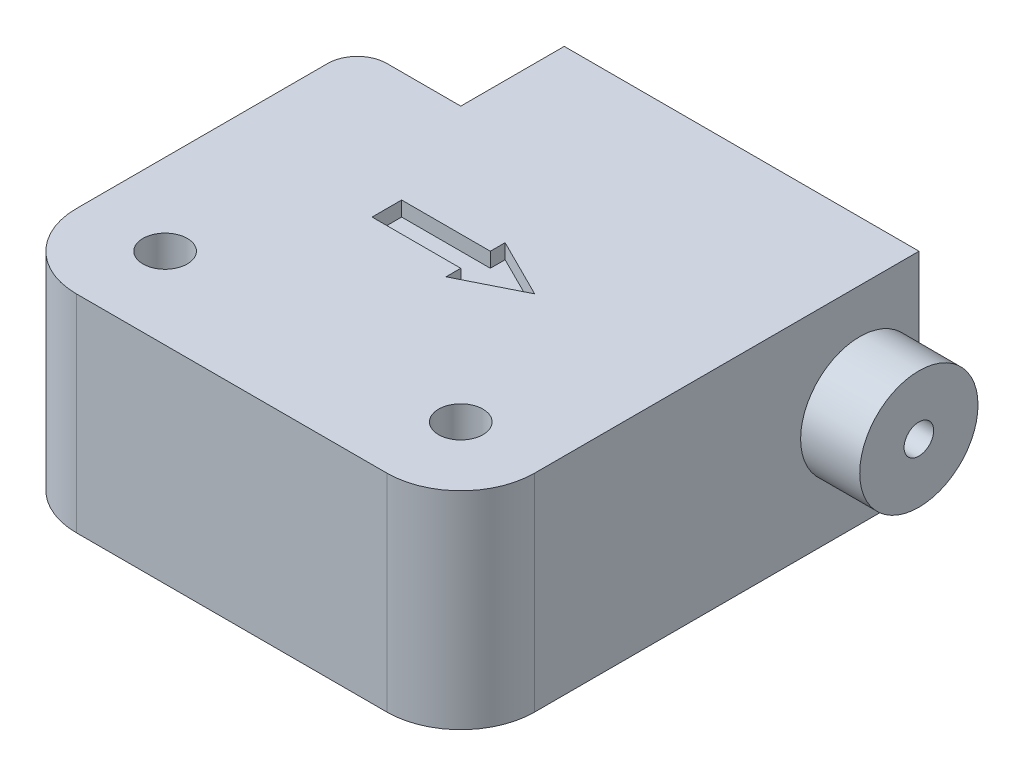
ISO-10303-21;
HEADER;
FILE_DESCRIPTION(('STEP AP214'),'2;1');
FILE_NAME('part.step','',(''),(''),'','','');
FILE_SCHEMA(('AUTOMOTIVE_DESIGN { 1 0 10303 214 1 1 1 1 }'));
ENDSEC;
DATA;
#1=APPLICATION_CONTEXT('core data for automotive mechanical design processes');
#2=APPLICATION_PROTOCOL_DEFINITION('international standard','automotive_design',2000,#1);
#3=PRODUCT_CONTEXT('',#1,'mechanical');
#4=PRODUCT('Part','Part','',(#3));
#5=PRODUCT_RELATED_PRODUCT_CATEGORY('part','',(#4));
#6=PRODUCT_DEFINITION_FORMATION('','',#4);
#7=PRODUCT_DEFINITION_CONTEXT('part definition',#1,'design');
#8=PRODUCT_DEFINITION('design','',#6,#7);
#9=PRODUCT_DEFINITION_SHAPE('','',#8);
#10=(LENGTH_UNIT() NAMED_UNIT(*) SI_UNIT(.MILLI.,.METRE.));
#11=(NAMED_UNIT(*) PLANE_ANGLE_UNIT() SI_UNIT($,.RADIAN.));
#12=(NAMED_UNIT(*) SI_UNIT($,.STERADIAN.) SOLID_ANGLE_UNIT());
#13=UNCERTAINTY_MEASURE_WITH_UNIT(LENGTH_MEASURE(1.E-05),#10,'distance_accuracy_value','');
#14=(GEOMETRIC_REPRESENTATION_CONTEXT(3) GLOBAL_UNCERTAINTY_ASSIGNED_CONTEXT((#13)) GLOBAL_UNIT_ASSIGNED_CONTEXT((#10,
#11,#12)) REPRESENTATION_CONTEXT('',''));
#15=CARTESIAN_POINT('',(0.,0.,0.));
#16=DIRECTION('',(0.,0.,1.));
#17=DIRECTION('',(1.,0.,0.));
#18=AXIS2_PLACEMENT_3D('',#15,#16,#17);
#19=CARTESIAN_POINT('',(-8.5,14.,0.));
#20=DIRECTION('',(1.,0.,0.));
#21=DIRECTION('',(0.,0.,-1.));
#22=AXIS2_PLACEMENT_3D('',#19,#20,#21);
#23=PLANE('',#22);
#24=CARTESIAN_POINT('',(-8.5,7.,-11.49));
#25=DIRECTION('',(1.,0.,0.));
#26=DIRECTION('',(0.,0.,-1.));
#27=AXIS2_PLACEMENT_3D('',#24,#25,#26);
#28=CIRCLE('',#27,1.);
#29=CARTESIAN_POINT('',(-8.5,7.,-12.49));
#30=VERTEX_POINT('',#29);
#31=EDGE_CURVE('E359',#30,#30,#28,.T.);
#32=ORIENTED_EDGE('',*,*,#31,.T.);
#33=EDGE_LOOP('',(#32));
#34=FACE_BOUND('',#33,.T.);
#35=DIRECTION('',(0.,0.,1.));
#36=VECTOR('',#35,1.);
#37=CARTESIAN_POINT('',(-8.5,0.,0.));
#38=LINE('',#37,#36);
#39=CARTESIAN_POINT('',(-8.5,0.,-15.5));
#40=VERTEX_POINT('',#39);
#41=CARTESIAN_POINT('',(-8.5,0.,-8.5));
#42=VERTEX_POINT('',#41);
#43=EDGE_CURVE('E407',#40,#42,#38,.T.);
#44=ORIENTED_EDGE('',*,*,#43,.T.);
#45=DIRECTION('',(0.,-1.,0.));
#46=VECTOR('',#45,1.);
#47=CARTESIAN_POINT('',(-8.5,14.,-8.5));
#48=LINE('',#47,#46);
#49=CARTESIAN_POINT('',(-8.5,14.,-8.5));
#50=VERTEX_POINT('',#49);
#51=EDGE_CURVE('E434',#50,#42,#48,.T.);
#52=ORIENTED_EDGE('',*,*,#51,.F.);
#53=DIRECTION('',(0.,0.,1.));
#54=VECTOR('',#53,1.);
#55=CARTESIAN_POINT('',(-8.5,14.,0.));
#56=LINE('',#55,#54);
#57=CARTESIAN_POINT('',(-8.5,14.,-15.5));
#58=VERTEX_POINT('',#57);
#59=EDGE_CURVE('E377',#58,#50,#56,.T.);
#60=ORIENTED_EDGE('',*,*,#59,.F.);
#61=DIRECTION('',(0.,-1.,0.));
#62=VECTOR('',#61,1.);
#63=CARTESIAN_POINT('',(-8.5,14.,-15.5));
#64=LINE('',#63,#62);
#65=EDGE_CURVE('E399',#58,#40,#64,.T.);
#66=ORIENTED_EDGE('',*,*,#65,.T.);
#67=EDGE_LOOP('',(#44,#52,#60,#66));
#68=FACE_BOUND('',#67,.T.);
#69=ADVANCED_FACE('F41',(#34,#68),#23,.F.);
#70=CARTESIAN_POINT('',(0.,14.,-8.5));
#71=DIRECTION('',(0.,0.,1.));
#72=DIRECTION('',(1.,0.,0.));
#73=AXIS2_PLACEMENT_3D('',#70,#71,#72);
#74=PLANE('',#73);
#75=DIRECTION('',(-1.,0.,0.));
#76=VECTOR('',#75,1.);
#77=CARTESIAN_POINT('',(0.,0.,-8.5));
#78=LINE('',#77,#76);
#79=CARTESIAN_POINT('',(-13.5,0.,-8.5));
#80=VERTEX_POINT('',#79);
#81=EDGE_CURVE('E411',#42,#80,#78,.T.);
#82=ORIENTED_EDGE('',*,*,#81,.T.);
#83=DIRECTION('',(0.,-1.,0.));
#84=VECTOR('',#83,1.);
#85=CARTESIAN_POINT('',(-13.5,14.,-8.5));
#86=LINE('',#85,#84);
#87=CARTESIAN_POINT('',(-13.5,14.,-8.5));
#88=VERTEX_POINT('',#87);
#89=EDGE_CURVE('E473',#80,#88,#86,.F.);
#90=ORIENTED_EDGE('',*,*,#89,.T.);
#91=DIRECTION('',(-1.,0.,0.));
#92=VECTOR('',#91,1.);
#93=CARTESIAN_POINT('',(0.,14.,-8.5));
#94=LINE('',#93,#92);
#95=EDGE_CURVE('E381',#50,#88,#94,.T.);
#96=ORIENTED_EDGE('',*,*,#95,.F.);
#97=ORIENTED_EDGE('',*,*,#51,.T.);
#98=EDGE_LOOP('',(#82,#90,#96,#97));
#99=FACE_BOUND('',#98,.T.);
#100=ADVANCED_FACE('F492',(#99),#74,.F.);
#101=CARTESIAN_POINT('',(-15.5,14.,0.));
#102=DIRECTION('',(1.,0.,0.));
#103=DIRECTION('',(0.,0.,-1.));
#104=AXIS2_PLACEMENT_3D('',#101,#102,#103);
#105=PLANE('',#104);
#106=DIRECTION('',(0.,0.,1.));
#107=VECTOR('',#106,1.);
#108=CARTESIAN_POINT('',(-15.5,14.,0.));
#109=LINE('',#108,#107);
#110=CARTESIAN_POINT('',(-15.5,14.,-6.5));
#111=VERTEX_POINT('',#110);
#112=CARTESIAN_POINT('',(-15.5,14.,10.5));
#113=VERTEX_POINT('',#112);
#114=EDGE_CURVE('E385',#111,#113,#109,.T.);
#115=ORIENTED_EDGE('',*,*,#114,.F.);
#116=DIRECTION('',(0.,-1.,0.));
#117=VECTOR('',#116,1.);
#118=CARTESIAN_POINT('',(-15.5,14.,-6.5));
#119=LINE('',#118,#117);
#120=CARTESIAN_POINT('',(-15.5,0.,-6.5));
#121=VERTEX_POINT('',#120);
#122=EDGE_CURVE('E466',#111,#121,#119,.T.);
#123=ORIENTED_EDGE('',*,*,#122,.T.);
#124=DIRECTION('',(0.,0.,1.));
#125=VECTOR('',#124,1.);
#126=CARTESIAN_POINT('',(-15.5,0.,0.));
#127=LINE('',#126,#125);
#128=CARTESIAN_POINT('',(-15.5,0.,10.5));
#129=VERTEX_POINT('',#128);
#130=EDGE_CURVE('E415',#121,#129,#127,.T.);
#131=ORIENTED_EDGE('',*,*,#130,.T.);
#132=DIRECTION('',(0.,-1.,0.));
#133=VECTOR('',#132,1.);
#134=CARTESIAN_POINT('',(-15.5,14.,10.5));
#135=LINE('',#134,#133);
#136=EDGE_CURVE('E452',#129,#113,#135,.F.);
#137=ORIENTED_EDGE('',*,*,#136,.T.);
#138=EDGE_LOOP('',(#115,#123,#131,#137));
#139=FACE_BOUND('',#138,.T.);
#140=ADVANCED_FACE('F484',(#139),#105,.F.);
#141=CARTESIAN_POINT('',(0.,14.,15.5));
#142=DIRECTION('',(0.,0.,-1.));
#143=DIRECTION('',(-1.,0.,0.));
#144=AXIS2_PLACEMENT_3D('',#141,#142,#143);
#145=PLANE('',#144);
#146=DIRECTION('',(1.,0.,0.));
#147=VECTOR('',#146,1.);
#148=CARTESIAN_POINT('',(0.,14.,15.5));
#149=LINE('',#148,#147);
#150=CARTESIAN_POINT('',(-10.5,14.,15.5));
#151=VERTEX_POINT('',#150);
#152=CARTESIAN_POINT('',(10.5,14.,15.5));
#153=VERTEX_POINT('',#152);
#154=EDGE_CURVE('E388',#151,#153,#149,.T.);
#155=ORIENTED_EDGE('',*,*,#154,.F.);
#156=DIRECTION('',(0.,-1.,0.));
#157=VECTOR('',#156,1.);
#158=CARTESIAN_POINT('',(-10.5,14.,15.5));
#159=LINE('',#158,#157);
#160=CARTESIAN_POINT('',(-10.5,0.,15.5));
#161=VERTEX_POINT('',#160);
#162=EDGE_CURVE('E441',#151,#161,#159,.T.);
#163=ORIENTED_EDGE('',*,*,#162,.T.);
#164=DIRECTION('',(1.,0.,0.));
#165=VECTOR('',#164,1.);
#166=CARTESIAN_POINT('',(0.,0.,15.5));
#167=LINE('',#166,#165);
#168=CARTESIAN_POINT('',(10.5,0.,15.5));
#169=VERTEX_POINT('',#168);
#170=EDGE_CURVE('E418',#161,#169,#167,.T.);
#171=ORIENTED_EDGE('',*,*,#170,.T.);
#172=DIRECTION('',(0.,-1.,0.));
#173=VECTOR('',#172,1.);
#174=CARTESIAN_POINT('',(10.5,14.,15.5));
#175=LINE('',#174,#173);
#176=EDGE_CURVE('E438',#169,#153,#175,.F.);
#177=ORIENTED_EDGE('',*,*,#176,.T.);
#178=EDGE_LOOP('',(#155,#163,#171,#177));
#179=FACE_BOUND('',#178,.T.);
#180=ADVANCED_FACE('F511',(#179),#145,.F.);
#181=CARTESIAN_POINT('',(15.5,14.,0.));
#182=DIRECTION('',(-1.,0.,0.));
#183=DIRECTION('',(0.,0.,1.));
#184=AXIS2_PLACEMENT_3D('',#181,#182,#183);
#185=PLANE('',#184);
#186=CARTESIAN_POINT('',(15.5,7.,-11.49));
#187=DIRECTION('',(-1.,0.,0.));
#188=DIRECTION('',(0.,0.,1.));
#189=AXIS2_PLACEMENT_3D('',#186,#187,#188);
#190=CIRCLE('',#189,4.);
#191=CARTESIAN_POINT('',(15.5,7.,-7.49));
#192=VERTEX_POINT('',#191);
#193=EDGE_CURVE('E11',#192,#192,#190,.F.);
#194=ORIENTED_EDGE('',*,*,#193,.F.);
#195=EDGE_LOOP('',(#194));
#196=FACE_BOUND('',#195,.T.);
#197=DIRECTION('',(0.,0.,-1.));
#198=VECTOR('',#197,1.);
#199=CARTESIAN_POINT('',(15.5,14.,0.));
#200=LINE('',#199,#198);
#201=CARTESIAN_POINT('',(15.5,14.,10.5));
#202=VERTEX_POINT('',#201);
#203=CARTESIAN_POINT('',(15.5,14.,-15.5));
#204=VERTEX_POINT('',#203);
#205=EDGE_CURVE('E392',#202,#204,#200,.T.);
#206=ORIENTED_EDGE('',*,*,#205,.F.);
#207=DIRECTION('',(0.,-1.,0.));
#208=VECTOR('',#207,1.);
#209=CARTESIAN_POINT('',(15.5,14.,10.5));
#210=LINE('',#209,#208);
#211=CARTESIAN_POINT('',(15.5,0.,10.5));
#212=VERTEX_POINT('',#211);
#213=EDGE_CURVE('E462',#202,#212,#210,.T.);
#214=ORIENTED_EDGE('',*,*,#213,.T.);
#215=DIRECTION('',(0.,0.,-1.));
#216=VECTOR('',#215,1.);
#217=CARTESIAN_POINT('',(15.5,0.,0.));
#218=LINE('',#217,#216);
#219=CARTESIAN_POINT('',(15.5,0.,-15.5));
#220=VERTEX_POINT('',#219);
#221=EDGE_CURVE('E422',#212,#220,#218,.T.);
#222=ORIENTED_EDGE('',*,*,#221,.T.);
#223=DIRECTION('',(0.,-1.,0.));
#224=VECTOR('',#223,1.);
#225=CARTESIAN_POINT('',(15.5,14.,-15.5));
#226=LINE('',#225,#224);
#227=EDGE_CURVE('E430',#204,#220,#226,.T.);
#228=ORIENTED_EDGE('',*,*,#227,.F.);
#229=EDGE_LOOP('',(#206,#214,#222,#228));
#230=FACE_BOUND('',#229,.T.);
#231=ADVANCED_FACE('F504',(#196,#230),#185,.F.);
#232=CARTESIAN_POINT('',(10.,14.,10.));
#233=DIRECTION('',(0.,-1.,0.));
#234=DIRECTION('',(0.,0.,-1.));
#235=AXIS2_PLACEMENT_3D('',#232,#233,#234);
#236=CYLINDRICAL_SURFACE('',#235,1.5);
#237=CARTESIAN_POINT('',(10.,14.,10.));
#238=DIRECTION('',(0.,1.,0.));
#239=DIRECTION('',(0.,0.,1.));
#240=AXIS2_PLACEMENT_3D('',#237,#238,#239);
#241=CIRCLE('',#240,1.5);
#242=CARTESIAN_POINT('',(10.,14.,11.5));
#243=VERTEX_POINT('',#242);
#244=EDGE_CURVE('E372',#243,#243,#241,.T.);
#245=ORIENTED_EDGE('',*,*,#244,.T.);
#246=EDGE_LOOP('',(#245));
#247=FACE_BOUND('',#246,.T.);
#248=CARTESIAN_POINT('',(10.,0.,10.));
#249=DIRECTION('',(0.,1.,0.));
#250=DIRECTION('',(0.,0.,1.));
#251=AXIS2_PLACEMENT_3D('',#248,#249,#250);
#252=CIRCLE('',#251,1.5);
#253=CARTESIAN_POINT('',(10.,0.,11.5));
#254=VERTEX_POINT('',#253);
#255=EDGE_CURVE('E403',#254,#254,#252,.T.);
#256=ORIENTED_EDGE('',*,*,#255,.F.);
#257=EDGE_LOOP('',(#256));
#258=FACE_BOUND('',#257,.T.);
#259=ADVANCED_FACE('F535',(#247,#258),#236,.F.);
#260=CARTESIAN_POINT('',(-10.,14.,10.));
#261=DIRECTION('',(0.,-1.,0.));
#262=DIRECTION('',(0.,0.,-1.));
#263=AXIS2_PLACEMENT_3D('',#260,#261,#262);
#264=CYLINDRICAL_SURFACE('',#263,1.5);
#265=CARTESIAN_POINT('',(-10.,14.,10.));
#266=DIRECTION('',(0.,1.,0.));
#267=DIRECTION('',(0.,0.,1.));
#268=AXIS2_PLACEMENT_3D('',#265,#266,#267);
#269=CIRCLE('',#268,1.5);
#270=CARTESIAN_POINT('',(-10.,14.,11.5));
#271=VERTEX_POINT('',#270);
#272=EDGE_CURVE('E368',#271,#271,#269,.T.);
#273=ORIENTED_EDGE('',*,*,#272,.T.);
#274=EDGE_LOOP('',(#273));
#275=FACE_BOUND('',#274,.T.);
#276=CARTESIAN_POINT('',(-10.,0.,10.));
#277=DIRECTION('',(0.,1.,0.));
#278=DIRECTION('',(0.,0.,1.));
#279=AXIS2_PLACEMENT_3D('',#276,#277,#278);
#280=CIRCLE('',#279,1.5);
#281=CARTESIAN_POINT('',(-10.,0.,11.5));
#282=VERTEX_POINT('',#281);
#283=EDGE_CURVE('E367',#282,#282,#280,.T.);
#284=ORIENTED_EDGE('',*,*,#283,.F.);
#285=EDGE_LOOP('',(#284));
#286=FACE_BOUND('',#285,.T.);
#287=ADVANCED_FACE('F537',(#275,#286),#264,.F.);
#288=CARTESIAN_POINT('',(0.,14.,-15.5));
#289=DIRECTION('',(0.,0.,-1.));
#290=DIRECTION('',(-1.,0.,0.));
#291=AXIS2_PLACEMENT_3D('',#288,#289,#290);
#292=PLANE('',#291);
#293=DIRECTION('',(1.,0.,0.));
#294=VECTOR('',#293,1.);
#295=CARTESIAN_POINT('',(0.,0.,-15.5));
#296=LINE('',#295,#294);
#297=EDGE_CURVE('E373',#40,#220,#296,.T.);
#298=ORIENTED_EDGE('',*,*,#297,.F.);
#299=ORIENTED_EDGE('',*,*,#65,.F.);
#300=DIRECTION('',(1.,0.,0.));
#301=VECTOR('',#300,1.);
#302=CARTESIAN_POINT('',(0.,14.,-15.5));
#303=LINE('',#302,#301);
#304=EDGE_CURVE('E395',#58,#204,#303,.T.);
#305=ORIENTED_EDGE('',*,*,#304,.T.);
#306=ORIENTED_EDGE('',*,*,#227,.T.);
#307=EDGE_LOOP('',(#298,#299,#305,#306));
#308=FACE_BOUND('',#307,.T.);
#309=ADVANCED_FACE('F499',(#308),#292,.T.);
#310=CARTESIAN_POINT('',(0.,14.,0.));
#311=DIRECTION('',(0.,1.,0.));
#312=DIRECTION('',(0.,0.,1.));
#313=AXIS2_PLACEMENT_3D('',#310,#311,#312);
#314=PLANE('',#313);
#315=DIRECTION('',(-0.894427190999916,0.,-0.447213595499958));
#316=VECTOR('',#315,1.);
#317=CARTESIAN_POINT('',(1.,14.,-2.));
#318=LINE('',#317,#316);
#319=CARTESIAN_POINT('',(5.,14.,0.));
#320=VERTEX_POINT('',#319);
#321=CARTESIAN_POINT('',(1.,14.,-2.));
#322=VERTEX_POINT('',#321);
#323=EDGE_CURVE('E65',#320,#322,#318,.T.);
#324=ORIENTED_EDGE('',*,*,#323,.F.);
#325=DIRECTION('',(0.894427190999916,0.,-0.447213595499958));
#326=VECTOR('',#325,1.);
#327=CARTESIAN_POINT('',(1.,14.,2.));
#328=LINE('',#327,#326);
#329=CARTESIAN_POINT('',(1.,14.,2.));
#330=VERTEX_POINT('',#329);
#331=EDGE_CURVE('E285',#330,#320,#328,.T.);
#332=ORIENTED_EDGE('',*,*,#331,.F.);
#333=DIRECTION('',(0.,0.,1.));
#334=VECTOR('',#333,1.);
#335=CARTESIAN_POINT('',(1.,14.,1.));
#336=LINE('',#335,#334);
#337=CARTESIAN_POINT('',(1.,14.,1.));
#338=VERTEX_POINT('',#337);
#339=EDGE_CURVE('E328',#338,#330,#336,.T.);
#340=ORIENTED_EDGE('',*,*,#339,.F.);
#341=DIRECTION('',(1.,0.,0.));
#342=VECTOR('',#341,1.);
#343=CARTESIAN_POINT('',(-5.,14.,1.));
#344=LINE('',#343,#342);
#345=CARTESIAN_POINT('',(-5.,14.,1.));
#346=VERTEX_POINT('',#345);
#347=EDGE_CURVE('E324',#346,#338,#344,.T.);
#348=ORIENTED_EDGE('',*,*,#347,.F.);
#349=DIRECTION('',(0.,0.,1.));
#350=VECTOR('',#349,1.);
#351=CARTESIAN_POINT('',(-5.,14.,-1.));
#352=LINE('',#351,#350);
#353=CARTESIAN_POINT('',(-5.,14.,-1.));
#354=VERTEX_POINT('',#353);
#355=EDGE_CURVE('E320',#354,#346,#352,.T.);
#356=ORIENTED_EDGE('',*,*,#355,.F.);
#357=DIRECTION('',(-1.,0.,0.));
#358=VECTOR('',#357,1.);
#359=CARTESIAN_POINT('',(-5.,14.,-1.));
#360=LINE('',#359,#358);
#361=CARTESIAN_POINT('',(1.,14.,-1.));
#362=VERTEX_POINT('',#361);
#363=EDGE_CURVE('E316',#362,#354,#360,.T.);
#364=ORIENTED_EDGE('',*,*,#363,.F.);
#365=DIRECTION('',(0.,0.,1.));
#366=VECTOR('',#365,1.);
#367=CARTESIAN_POINT('',(1.,14.,-1.));
#368=LINE('',#367,#366);
#369=EDGE_CURVE('E312',#322,#362,#368,.T.);
#370=ORIENTED_EDGE('',*,*,#369,.F.);
#371=EDGE_LOOP('',(#324,#332,#340,#348,#356,#364,#370));
#372=FACE_BOUND('',#371,.T.);
#373=ORIENTED_EDGE('',*,*,#272,.F.);
#374=EDGE_LOOP('',(#373));
#375=FACE_BOUND('',#374,.T.);
#376=ORIENTED_EDGE('',*,*,#244,.F.);
#377=EDGE_LOOP('',(#376));
#378=FACE_BOUND('',#377,.T.);
#379=ORIENTED_EDGE('',*,*,#95,.T.);
#380=CARTESIAN_POINT('',(-13.5,14.,-6.5));
#381=DIRECTION('',(0.,1.,0.));
#382=DIRECTION('',(0.,0.,1.));
#383=AXIS2_PLACEMENT_3D('',#380,#381,#382);
#384=CIRCLE('',#383,2.);
#385=EDGE_CURVE('E50',#88,#111,#384,.T.);
#386=ORIENTED_EDGE('',*,*,#385,.T.);
#387=ORIENTED_EDGE('',*,*,#114,.T.);
#388=CARTESIAN_POINT('',(-10.5,14.,10.5));
#389=DIRECTION('',(0.,1.,0.));
#390=DIRECTION('',(0.,0.,1.));
#391=AXIS2_PLACEMENT_3D('',#388,#389,#390);
#392=CIRCLE('',#391,5.);
#393=EDGE_CURVE('E459',#113,#151,#392,.T.);
#394=ORIENTED_EDGE('',*,*,#393,.T.);
#395=ORIENTED_EDGE('',*,*,#154,.T.);
#396=CARTESIAN_POINT('',(10.5,14.,10.5));
#397=DIRECTION('',(0.,1.,0.));
#398=DIRECTION('',(0.,0.,1.));
#399=AXIS2_PLACEMENT_3D('',#396,#397,#398);
#400=CIRCLE('',#399,5.);
#401=EDGE_CURVE('E456',#153,#202,#400,.T.);
#402=ORIENTED_EDGE('',*,*,#401,.T.);
#403=ORIENTED_EDGE('',*,*,#205,.T.);
#404=ORIENTED_EDGE('',*,*,#304,.F.);
#405=ORIENTED_EDGE('',*,*,#59,.T.);
#406=EDGE_LOOP('',(#379,#386,#387,#394,#395,#402,#403,#404,#405));
#407=FACE_BOUND('',#406,.T.);
#408=ADVANCED_FACE('F479',(#372,#375,#378,#407),#314,.T.);
#409=CARTESIAN_POINT('',(0.,0.,0.));
#410=DIRECTION('',(0.,1.,0.));
#411=DIRECTION('',(0.,0.,1.));
#412=AXIS2_PLACEMENT_3D('',#409,#410,#411);
#413=PLANE('',#412);
#414=DIRECTION('',(0.,0.,-1.));
#415=VECTOR('',#414,1.);
#416=CARTESIAN_POINT('',(0.876341267344725,0.,1.02166998706791));
#417=LINE('',#416,#415);
#418=CARTESIAN_POINT('',(0.876341267344726,0.,2.02166998706791));
#419=VERTEX_POINT('',#418);
#420=CARTESIAN_POINT('',(0.876341267344725,0.,1.02166998706791));
#421=VERTEX_POINT('',#420);
#422=EDGE_CURVE('E245',#419,#421,#417,.T.);
#423=ORIENTED_EDGE('',*,*,#422,.F.);
#424=DIRECTION('',(-0.894427190999916,0.,0.447213595499958));
#425=VECTOR('',#424,1.);
#426=CARTESIAN_POINT('',(0.876341267344726,0.,2.02166998706791));
#427=LINE('',#426,#425);
#428=CARTESIAN_POINT('',(4.87634126734473,0.,0.0216699870679138));
#429=VERTEX_POINT('',#428);
#430=EDGE_CURVE('E57',#429,#419,#427,.T.);
#431=ORIENTED_EDGE('',*,*,#430,.F.);
#432=DIRECTION('',(0.894427190999916,0.,0.447213595499958));
#433=VECTOR('',#432,1.);
#434=CARTESIAN_POINT('',(0.876341267344726,0.,-1.97833001293209));
#435=LINE('',#434,#433);
#436=CARTESIAN_POINT('',(0.876341267344726,0.,-1.97833001293209));
#437=VERTEX_POINT('',#436);
#438=EDGE_CURVE('E221',#437,#429,#435,.T.);
#439=ORIENTED_EDGE('',*,*,#438,.F.);
#440=DIRECTION('',(0.,0.,-1.));
#441=VECTOR('',#440,1.);
#442=CARTESIAN_POINT('',(0.876341267344725,0.,-0.978330012932088));
#443=LINE('',#442,#441);
#444=CARTESIAN_POINT('',(0.876341267344725,0.,-0.978330012932088));
#445=VERTEX_POINT('',#444);
#446=EDGE_CURVE('E225',#445,#437,#443,.T.);
#447=ORIENTED_EDGE('',*,*,#446,.F.);
#448=DIRECTION('',(1.,0.,0.));
#449=VECTOR('',#448,1.);
#450=CARTESIAN_POINT('',(-5.12365873265527,0.,-0.978330012932088));
#451=LINE('',#450,#449);
#452=CARTESIAN_POINT('',(-5.12365873265527,0.,-0.978330012932088));
#453=VERTEX_POINT('',#452);
#454=EDGE_CURVE('E256',#453,#445,#451,.T.);
#455=ORIENTED_EDGE('',*,*,#454,.F.);
#456=DIRECTION('',(0.,0.,-1.));
#457=VECTOR('',#456,1.);
#458=CARTESIAN_POINT('',(-5.12365873265528,0.,1.02166998706791));
#459=LINE('',#458,#457);
#460=CARTESIAN_POINT('',(-5.12365873265528,0.,1.02166998706791));
#461=VERTEX_POINT('',#460);
#462=EDGE_CURVE('E252',#461,#453,#459,.T.);
#463=ORIENTED_EDGE('',*,*,#462,.F.);
#464=DIRECTION('',(-1.,0.,0.));
#465=VECTOR('',#464,1.);
#466=CARTESIAN_POINT('',(-5.12365873265528,0.,1.02166998706791));
#467=LINE('',#466,#465);
#468=EDGE_CURVE('E248',#421,#461,#467,.T.);
#469=ORIENTED_EDGE('',*,*,#468,.F.);
#470=EDGE_LOOP('',(#423,#431,#439,#447,#455,#463,#469));
#471=FACE_BOUND('',#470,.T.);
#472=ORIENTED_EDGE('',*,*,#283,.T.);
#473=EDGE_LOOP('',(#472));
#474=FACE_BOUND('',#473,.T.);
#475=ORIENTED_EDGE('',*,*,#255,.T.);
#476=EDGE_LOOP('',(#475));
#477=FACE_BOUND('',#476,.T.);
#478=ORIENTED_EDGE('',*,*,#130,.F.);
#479=CARTESIAN_POINT('',(-13.5,0.,-6.5));
#480=DIRECTION('',(0.,1.,0.));
#481=DIRECTION('',(0.,0.,1.));
#482=AXIS2_PLACEMENT_3D('',#479,#480,#481);
#483=CIRCLE('',#482,2.);
#484=EDGE_CURVE('E470',#121,#80,#483,.F.);
#485=ORIENTED_EDGE('',*,*,#484,.T.);
#486=ORIENTED_EDGE('',*,*,#81,.F.);
#487=ORIENTED_EDGE('',*,*,#43,.F.);
#488=ORIENTED_EDGE('',*,*,#297,.T.);
#489=ORIENTED_EDGE('',*,*,#221,.F.);
#490=CARTESIAN_POINT('',(10.5,0.,10.5));
#491=DIRECTION('',(0.,1.,0.));
#492=DIRECTION('',(0.,0.,1.));
#493=AXIS2_PLACEMENT_3D('',#490,#491,#492);
#494=CIRCLE('',#493,5.);
#495=EDGE_CURVE('E445',#212,#169,#494,.F.);
#496=ORIENTED_EDGE('',*,*,#495,.T.);
#497=ORIENTED_EDGE('',*,*,#170,.F.);
#498=CARTESIAN_POINT('',(-10.5,0.,10.5));
#499=DIRECTION('',(0.,1.,0.));
#500=DIRECTION('',(0.,0.,1.));
#501=AXIS2_PLACEMENT_3D('',#498,#499,#500);
#502=CIRCLE('',#501,5.);
#503=EDGE_CURVE('E448',#161,#129,#502,.F.);
#504=ORIENTED_EDGE('',*,*,#503,.T.);
#505=EDGE_LOOP('',(#478,#485,#486,#487,#488,#489,#496,#497,#504));
#506=FACE_BOUND('',#505,.T.);
#507=ADVANCED_FACE('F489',(#471,#474,#477,#506),#413,.F.);
#508=CARTESIAN_POINT('',(-10.5,14.,10.5));
#509=DIRECTION('',(0.,-1.,0.));
#510=DIRECTION('',(0.,0.,-1.));
#511=AXIS2_PLACEMENT_3D('',#508,#509,#510);
#512=CYLINDRICAL_SURFACE('',#511,5.);
#513=ORIENTED_EDGE('',*,*,#393,.F.);
#514=ORIENTED_EDGE('',*,*,#136,.F.);
#515=ORIENTED_EDGE('',*,*,#503,.F.);
#516=ORIENTED_EDGE('',*,*,#162,.F.);
#517=EDGE_LOOP('',(#513,#514,#515,#516));
#518=FACE_BOUND('',#517,.T.);
#519=ADVANCED_FACE('F516',(#518),#512,.T.);
#520=CARTESIAN_POINT('',(10.5,14.,10.5));
#521=DIRECTION('',(0.,-1.,0.));
#522=DIRECTION('',(0.,0.,-1.));
#523=AXIS2_PLACEMENT_3D('',#520,#521,#522);
#524=CYLINDRICAL_SURFACE('',#523,5.);
#525=ORIENTED_EDGE('',*,*,#401,.F.);
#526=ORIENTED_EDGE('',*,*,#176,.F.);
#527=ORIENTED_EDGE('',*,*,#495,.F.);
#528=ORIENTED_EDGE('',*,*,#213,.F.);
#529=EDGE_LOOP('',(#525,#526,#527,#528));
#530=FACE_BOUND('',#529,.T.);
#531=ADVANCED_FACE('F514',(#530),#524,.T.);
#532=CARTESIAN_POINT('',(-13.5,14.,-6.5));
#533=DIRECTION('',(0.,-1.,0.));
#534=DIRECTION('',(0.,0.,-1.));
#535=AXIS2_PLACEMENT_3D('',#532,#533,#534);
#536=CYLINDRICAL_SURFACE('',#535,2.);
#537=ORIENTED_EDGE('',*,*,#385,.F.);
#538=ORIENTED_EDGE('',*,*,#89,.F.);
#539=ORIENTED_EDGE('',*,*,#484,.F.);
#540=ORIENTED_EDGE('',*,*,#122,.F.);
#541=EDGE_LOOP('',(#537,#538,#539,#540));
#542=FACE_BOUND('',#541,.T.);
#543=ADVANCED_FACE('F43',(#542),#536,.T.);
#544=CARTESIAN_POINT('',(19.5,7.,-11.49));
#545=DIRECTION('',(-1.,0.,0.));
#546=DIRECTION('',(0.,0.,1.));
#547=AXIS2_PLACEMENT_3D('',#544,#545,#546);
#548=CYLINDRICAL_SURFACE('',#547,4.);
#549=CARTESIAN_POINT('',(19.5,7.,-11.49));
#550=DIRECTION('',(1.,0.,0.));
#551=DIRECTION('',(0.,0.,-1.));
#552=AXIS2_PLACEMENT_3D('',#549,#550,#551);
#553=CIRCLE('',#552,4.);
#554=CARTESIAN_POINT('',(19.5,7.,-15.49));
#555=VERTEX_POINT('',#554);
#556=EDGE_CURVE('E363',#555,#555,#553,.T.);
#557=ORIENTED_EDGE('',*,*,#556,.F.);
#558=EDGE_LOOP('',(#557));
#559=FACE_BOUND('',#558,.T.);
#560=ORIENTED_EDGE('',*,*,#193,.T.);
#561=EDGE_LOOP('',(#560));
#562=FACE_BOUND('',#561,.T.);
#563=ADVANCED_FACE('F561',(#559,#562),#548,.T.);
#564=CARTESIAN_POINT('',(19.5,7.,-11.49));
#565=DIRECTION('',(1.,0.,0.));
#566=DIRECTION('',(0.,0.,-1.));
#567=AXIS2_PLACEMENT_3D('',#564,#565,#566);
#568=PLANE('',#567);
#569=CARTESIAN_POINT('',(19.5,7.,-11.49));
#570=DIRECTION('',(1.,0.,0.));
#571=DIRECTION('',(0.,0.,-1.));
#572=AXIS2_PLACEMENT_3D('',#569,#570,#571);
#573=CIRCLE('',#572,1.);
#574=CARTESIAN_POINT('',(19.5,7.,-12.49));
#575=VERTEX_POINT('',#574);
#576=EDGE_CURVE('E338',#575,#575,#573,.T.);
#577=ORIENTED_EDGE('',*,*,#576,.F.);
#578=EDGE_LOOP('',(#577));
#579=FACE_BOUND('',#578,.T.);
#580=ORIENTED_EDGE('',*,*,#556,.T.);
#581=EDGE_LOOP('',(#580));
#582=FACE_BOUND('',#581,.T.);
#583=ADVANCED_FACE('F633',(#579,#582),#568,.T.);
#584=CARTESIAN_POINT('',(-15.5,7.,-11.49));
#585=DIRECTION('',(1.,0.,0.));
#586=DIRECTION('',(0.,0.,-1.));
#587=AXIS2_PLACEMENT_3D('',#584,#585,#586);
#588=CYLINDRICAL_SURFACE('',#587,1.);
#589=ORIENTED_EDGE('',*,*,#576,.T.);
#590=EDGE_LOOP('',(#589));
#591=FACE_BOUND('',#590,.T.);
#592=ORIENTED_EDGE('',*,*,#31,.F.);
#593=EDGE_LOOP('',(#592));
#594=FACE_BOUND('',#593,.T.);
#595=ADVANCED_FACE('F641',(#591,#594),#588,.F.);
#596=CARTESIAN_POINT('',(1.,13.,-2.));
#597=DIRECTION('',(0.447213595499958,0.,-0.894427190999916));
#598=DIRECTION('',(-0.894427190999916,0.,-0.447213595499958));
#599=AXIS2_PLACEMENT_3D('',#596,#597,#598);
#600=PLANE('',#599);
#601=ORIENTED_EDGE('',*,*,#323,.T.);
#602=DIRECTION('',(0.,1.,0.));
#603=VECTOR('',#602,1.);
#604=CARTESIAN_POINT('',(1.,13.,-2.));
#605=LINE('',#604,#603);
#606=CARTESIAN_POINT('',(1.,13.,-2.));
#607=VERTEX_POINT('',#606);
#608=EDGE_CURVE('E309',#607,#322,#605,.T.);
#609=ORIENTED_EDGE('',*,*,#608,.F.);
#610=DIRECTION('',(-0.894427190999916,0.,-0.447213595499958));
#611=VECTOR('',#610,1.);
#612=CARTESIAN_POINT('',(1.,13.,-2.));
#613=LINE('',#612,#611);
#614=CARTESIAN_POINT('',(5.,13.,0.));
#615=VERTEX_POINT('',#614);
#616=EDGE_CURVE('E280',#615,#607,#613,.T.);
#617=ORIENTED_EDGE('',*,*,#616,.F.);
#618=DIRECTION('',(0.,1.,0.));
#619=VECTOR('',#618,1.);
#620=CARTESIAN_POINT('',(5.,13.,0.));
#621=LINE('',#620,#619);
#622=EDGE_CURVE('E335',#615,#320,#621,.T.);
#623=ORIENTED_EDGE('',*,*,#622,.T.);
#624=EDGE_LOOP('',(#601,#609,#617,#623));
#625=FACE_BOUND('',#624,.T.);
#626=ADVANCED_FACE('F648',(#625),#600,.F.);
#627=CARTESIAN_POINT('',(1.,13.,2.));
#628=DIRECTION('',(0.447213595499958,0.,0.894427190999916));
#629=DIRECTION('',(0.894427190999916,0.,-0.447213595499958));
#630=AXIS2_PLACEMENT_3D('',#627,#628,#629);
#631=PLANE('',#630);
#632=ORIENTED_EDGE('',*,*,#331,.T.);
#633=ORIENTED_EDGE('',*,*,#622,.F.);
#634=DIRECTION('',(0.894427190999916,0.,-0.447213595499958));
#635=VECTOR('',#634,1.);
#636=CARTESIAN_POINT('',(1.,13.,2.));
#637=LINE('',#636,#635);
#638=CARTESIAN_POINT('',(1.,13.,2.));
#639=VERTEX_POINT('',#638);
#640=EDGE_CURVE('E305',#639,#615,#637,.T.);
#641=ORIENTED_EDGE('',*,*,#640,.F.);
#642=DIRECTION('',(0.,1.,0.));
#643=VECTOR('',#642,1.);
#644=CARTESIAN_POINT('',(1.,13.,2.));
#645=LINE('',#644,#643);
#646=EDGE_CURVE('E339',#639,#330,#645,.T.);
#647=ORIENTED_EDGE('',*,*,#646,.T.);
#648=EDGE_LOOP('',(#632,#633,#641,#647));
#649=FACE_BOUND('',#648,.T.);
#650=ADVANCED_FACE('F656',(#649),#631,.F.);
#651=CARTESIAN_POINT('',(1.,13.,1.));
#652=DIRECTION('',(-1.,0.,0.));
#653=DIRECTION('',(0.,0.,1.));
#654=AXIS2_PLACEMENT_3D('',#651,#652,#653);
#655=PLANE('',#654);
#656=ORIENTED_EDGE('',*,*,#339,.T.);
#657=ORIENTED_EDGE('',*,*,#646,.F.);
#658=DIRECTION('',(0.,0.,1.));
#659=VECTOR('',#658,1.);
#660=CARTESIAN_POINT('',(1.,13.,1.));
#661=LINE('',#660,#659);
#662=CARTESIAN_POINT('',(1.,13.,1.));
#663=VERTEX_POINT('',#662);
#664=EDGE_CURVE('E301',#663,#639,#661,.T.);
#665=ORIENTED_EDGE('',*,*,#664,.F.);
#666=DIRECTION('',(0.,1.,0.));
#667=VECTOR('',#666,1.);
#668=CARTESIAN_POINT('',(1.,13.,1.));
#669=LINE('',#668,#667);
#670=EDGE_CURVE('E342',#663,#338,#669,.T.);
#671=ORIENTED_EDGE('',*,*,#670,.T.);
#672=EDGE_LOOP('',(#656,#657,#665,#671));
#673=FACE_BOUND('',#672,.T.);
#674=ADVANCED_FACE('F664',(#673),#655,.F.);
#675=CARTESIAN_POINT('',(-5.,13.,1.));
#676=DIRECTION('',(0.,0.,1.));
#677=DIRECTION('',(1.,0.,0.));
#678=AXIS2_PLACEMENT_3D('',#675,#676,#677);
#679=PLANE('',#678);
#680=ORIENTED_EDGE('',*,*,#347,.T.);
#681=ORIENTED_EDGE('',*,*,#670,.F.);
#682=DIRECTION('',(1.,0.,0.));
#683=VECTOR('',#682,1.);
#684=CARTESIAN_POINT('',(-5.,13.,1.));
#685=LINE('',#684,#683);
#686=CARTESIAN_POINT('',(-5.,13.,1.));
#687=VERTEX_POINT('',#686);
#688=EDGE_CURVE('E297',#687,#663,#685,.T.);
#689=ORIENTED_EDGE('',*,*,#688,.F.);
#690=DIRECTION('',(0.,1.,0.));
#691=VECTOR('',#690,1.);
#692=CARTESIAN_POINT('',(-5.,13.,1.));
#693=LINE('',#692,#691);
#694=EDGE_CURVE('E345',#687,#346,#693,.T.);
#695=ORIENTED_EDGE('',*,*,#694,.T.);
#696=EDGE_LOOP('',(#680,#681,#689,#695));
#697=FACE_BOUND('',#696,.T.);
#698=ADVANCED_FACE('F673',(#697),#679,.F.);
#699=CARTESIAN_POINT('',(-5.,13.,-1.));
#700=DIRECTION('',(-1.,0.,0.));
#701=DIRECTION('',(0.,0.,1.));
#702=AXIS2_PLACEMENT_3D('',#699,#700,#701);
#703=PLANE('',#702);
#704=ORIENTED_EDGE('',*,*,#355,.T.);
#705=ORIENTED_EDGE('',*,*,#694,.F.);
#706=DIRECTION('',(0.,0.,1.));
#707=VECTOR('',#706,1.);
#708=CARTESIAN_POINT('',(-5.,13.,-1.));
#709=LINE('',#708,#707);
#710=CARTESIAN_POINT('',(-5.,13.,-1.));
#711=VERTEX_POINT('',#710);
#712=EDGE_CURVE('E293',#711,#687,#709,.T.);
#713=ORIENTED_EDGE('',*,*,#712,.F.);
#714=DIRECTION('',(0.,1.,0.));
#715=VECTOR('',#714,1.);
#716=CARTESIAN_POINT('',(-5.,13.,-1.));
#717=LINE('',#716,#715);
#718=EDGE_CURVE('E348',#711,#354,#717,.T.);
#719=ORIENTED_EDGE('',*,*,#718,.T.);
#720=EDGE_LOOP('',(#704,#705,#713,#719));
#721=FACE_BOUND('',#720,.T.);
#722=ADVANCED_FACE('F682',(#721),#703,.F.);
#723=CARTESIAN_POINT('',(-5.,13.,-1.));
#724=DIRECTION('',(0.,0.,-1.));
#725=DIRECTION('',(-1.,0.,0.));
#726=AXIS2_PLACEMENT_3D('',#723,#724,#725);
#727=PLANE('',#726);
#728=ORIENTED_EDGE('',*,*,#363,.T.);
#729=ORIENTED_EDGE('',*,*,#718,.F.);
#730=DIRECTION('',(-1.,0.,0.));
#731=VECTOR('',#730,1.);
#732=CARTESIAN_POINT('',(-5.,13.,-1.));
#733=LINE('',#732,#731);
#734=CARTESIAN_POINT('',(1.,13.,-1.));
#735=VERTEX_POINT('',#734);
#736=EDGE_CURVE('E289',#735,#711,#733,.T.);
#737=ORIENTED_EDGE('',*,*,#736,.F.);
#738=DIRECTION('',(0.,1.,0.));
#739=VECTOR('',#738,1.);
#740=CARTESIAN_POINT('',(1.,13.,-1.));
#741=LINE('',#740,#739);
#742=EDGE_CURVE('E351',#735,#362,#741,.T.);
#743=ORIENTED_EDGE('',*,*,#742,.T.);
#744=EDGE_LOOP('',(#728,#729,#737,#743));
#745=FACE_BOUND('',#744,.T.);
#746=ADVANCED_FACE('F691',(#745),#727,.F.);
#747=CARTESIAN_POINT('',(1.,13.,-1.));
#748=DIRECTION('',(-1.,0.,0.));
#749=DIRECTION('',(0.,0.,1.));
#750=AXIS2_PLACEMENT_3D('',#747,#748,#749);
#751=PLANE('',#750);
#752=ORIENTED_EDGE('',*,*,#369,.T.);
#753=ORIENTED_EDGE('',*,*,#742,.F.);
#754=DIRECTION('',(0.,0.,1.));
#755=VECTOR('',#754,1.);
#756=CARTESIAN_POINT('',(1.,13.,-1.));
#757=LINE('',#756,#755);
#758=EDGE_CURVE('E284',#607,#735,#757,.T.);
#759=ORIENTED_EDGE('',*,*,#758,.F.);
#760=ORIENTED_EDGE('',*,*,#608,.T.);
#761=EDGE_LOOP('',(#752,#753,#759,#760));
#762=FACE_BOUND('',#761,.T.);
#763=ADVANCED_FACE('F700',(#762),#751,.F.);
#764=CARTESIAN_POINT('',(0.,13.,0.));
#765=DIRECTION('',(0.,-1.,0.));
#766=DIRECTION('',(0.,0.,-1.));
#767=AXIS2_PLACEMENT_3D('',#764,#765,#766);
#768=PLANE('',#767);
#769=ORIENTED_EDGE('',*,*,#616,.T.);
#770=ORIENTED_EDGE('',*,*,#758,.T.);
#771=ORIENTED_EDGE('',*,*,#736,.T.);
#772=ORIENTED_EDGE('',*,*,#712,.T.);
#773=ORIENTED_EDGE('',*,*,#688,.T.);
#774=ORIENTED_EDGE('',*,*,#664,.T.);
#775=ORIENTED_EDGE('',*,*,#640,.T.);
#776=EDGE_LOOP('',(#769,#770,#771,#772,#773,#774,#775));
#777=FACE_BOUND('',#776,.T.);
#778=ADVANCED_FACE('F709',(#777),#768,.F.);
#779=CARTESIAN_POINT('',(0.876341267344726,1.,2.02166998706791));
#780=DIRECTION('',(0.447213595499958,0.,0.894427190999916));
#781=DIRECTION('',(0.894427190999916,0.,-0.447213595499958));
#782=AXIS2_PLACEMENT_3D('',#779,#780,#781);
#783=PLANE('',#782);
#784=ORIENTED_EDGE('',*,*,#430,.T.);
#785=DIRECTION('',(0.,-1.,0.));
#786=VECTOR('',#785,1.);
#787=CARTESIAN_POINT('',(0.876341267344726,1.,2.02166998706791));
#788=LINE('',#787,#786);
#789=CARTESIAN_POINT('',(0.876341267344726,1.,2.02166998706791));
#790=VERTEX_POINT('',#789);
#791=EDGE_CURVE('E195',#790,#419,#788,.T.);
#792=ORIENTED_EDGE('',*,*,#791,.F.);
#793=DIRECTION('',(-0.894427190999916,0.,0.447213595499958));
#794=VECTOR('',#793,1.);
#795=CARTESIAN_POINT('',(0.876341267344726,1.,2.02166998706791));
#796=LINE('',#795,#794);
#797=CARTESIAN_POINT('',(4.87634126734473,1.,0.0216699870679138));
#798=VERTEX_POINT('',#797);
#799=EDGE_CURVE('E199',#798,#790,#796,.T.);
#800=ORIENTED_EDGE('',*,*,#799,.F.);
#801=DIRECTION('',(0.,-1.,0.));
#802=VECTOR('',#801,1.);
#803=CARTESIAN_POINT('',(4.87634126734473,1.,0.0216699870679138));
#804=LINE('',#803,#802);
#805=EDGE_CURVE('E263',#798,#429,#804,.T.);
#806=ORIENTED_EDGE('',*,*,#805,.T.);
#807=EDGE_LOOP('',(#784,#792,#800,#806));
#808=FACE_BOUND('',#807,.T.);
#809=ADVANCED_FACE('F197',(#808),#783,.F.);
#810=CARTESIAN_POINT('',(0.876341267344726,1.,-1.97833001293209));
#811=DIRECTION('',(0.447213595499958,0.,-0.894427190999916));
#812=DIRECTION('',(-0.894427190999916,0.,-0.447213595499958));
#813=AXIS2_PLACEMENT_3D('',#810,#811,#812);
#814=PLANE('',#813);
#815=ORIENTED_EDGE('',*,*,#438,.T.);
#816=ORIENTED_EDGE('',*,*,#805,.F.);
#817=DIRECTION('',(0.894427190999916,0.,0.447213595499958));
#818=VECTOR('',#817,1.);
#819=CARTESIAN_POINT('',(0.876341267344726,1.,-1.97833001293209));
#820=LINE('',#819,#818);
#821=CARTESIAN_POINT('',(0.876341267344726,1.,-1.97833001293209));
#822=VERTEX_POINT('',#821);
#823=EDGE_CURVE('E206',#822,#798,#820,.T.);
#824=ORIENTED_EDGE('',*,*,#823,.F.);
#825=DIRECTION('',(0.,-1.,0.));
#826=VECTOR('',#825,1.);
#827=CARTESIAN_POINT('',(0.876341267344726,1.,-1.97833001293209));
#828=LINE('',#827,#826);
#829=EDGE_CURVE('E266',#822,#437,#828,.T.);
#830=ORIENTED_EDGE('',*,*,#829,.T.);
#831=EDGE_LOOP('',(#815,#816,#824,#830));
#832=FACE_BOUND('',#831,.T.);
#833=ADVANCED_FACE('F724',(#832),#814,.F.);
#834=CARTESIAN_POINT('',(0.876341267344725,1.,-0.978330012932088));
#835=DIRECTION('',(-1.,0.,0.));
#836=DIRECTION('',(0.,0.,1.));
#837=AXIS2_PLACEMENT_3D('',#834,#835,#836);
#838=PLANE('',#837);
#839=ORIENTED_EDGE('',*,*,#446,.T.);
#840=ORIENTED_EDGE('',*,*,#829,.F.);
#841=DIRECTION('',(0.,0.,-1.));
#842=VECTOR('',#841,1.);
#843=CARTESIAN_POINT('',(0.876341267344725,1.,-0.978330012932088));
#844=LINE('',#843,#842);
#845=CARTESIAN_POINT('',(0.876341267344725,1.,-0.978330012932088));
#846=VERTEX_POINT('',#845);
#847=EDGE_CURVE('E238',#846,#822,#844,.T.);
#848=ORIENTED_EDGE('',*,*,#847,.F.);
#849=DIRECTION('',(0.,-1.,0.));
#850=VECTOR('',#849,1.);
#851=CARTESIAN_POINT('',(0.876341267344725,1.,-0.978330012932088));
#852=LINE('',#851,#850);
#853=EDGE_CURVE('E269',#846,#445,#852,.T.);
#854=ORIENTED_EDGE('',*,*,#853,.T.);
#855=EDGE_LOOP('',(#839,#840,#848,#854));
#856=FACE_BOUND('',#855,.T.);
#857=ADVANCED_FACE('F732',(#856),#838,.F.);
#858=CARTESIAN_POINT('',(-5.12365873265527,1.,-0.978330012932088));
#859=DIRECTION('',(0.,0.,-1.));
#860=DIRECTION('',(-1.,0.,0.));
#861=AXIS2_PLACEMENT_3D('',#858,#859,#860);
#862=PLANE('',#861);
#863=ORIENTED_EDGE('',*,*,#454,.T.);
#864=ORIENTED_EDGE('',*,*,#853,.F.);
#865=DIRECTION('',(1.,0.,0.));
#866=VECTOR('',#865,1.);
#867=CARTESIAN_POINT('',(-5.12365873265527,1.,-0.978330012932088));
#868=LINE('',#867,#866);
#869=CARTESIAN_POINT('',(-5.12365873265527,1.,-0.978330012932088));
#870=VERTEX_POINT('',#869);
#871=EDGE_CURVE('E234',#870,#846,#868,.T.);
#872=ORIENTED_EDGE('',*,*,#871,.F.);
#873=DIRECTION('',(0.,-1.,0.));
#874=VECTOR('',#873,1.);
#875=CARTESIAN_POINT('',(-5.12365873265527,1.,-0.978330012932088));
#876=LINE('',#875,#874);
#877=EDGE_CURVE('E272',#870,#453,#876,.T.);
#878=ORIENTED_EDGE('',*,*,#877,.T.);
#879=EDGE_LOOP('',(#863,#864,#872,#878));
#880=FACE_BOUND('',#879,.T.);
#881=ADVANCED_FACE('F741',(#880),#862,.F.);
#882=CARTESIAN_POINT('',(-5.12365873265528,1.,1.02166998706791));
#883=DIRECTION('',(-1.,0.,0.));
#884=DIRECTION('',(0.,0.,1.));
#885=AXIS2_PLACEMENT_3D('',#882,#883,#884);
#886=PLANE('',#885);
#887=ORIENTED_EDGE('',*,*,#462,.T.);
#888=ORIENTED_EDGE('',*,*,#877,.F.);
#889=DIRECTION('',(0.,0.,-1.));
#890=VECTOR('',#889,1.);
#891=CARTESIAN_POINT('',(-5.12365873265528,1.,1.02166998706791));
#892=LINE('',#891,#890);
#893=CARTESIAN_POINT('',(-5.12365873265528,1.,1.02166998706791));
#894=VERTEX_POINT('',#893);
#895=EDGE_CURVE('E230',#894,#870,#892,.T.);
#896=ORIENTED_EDGE('',*,*,#895,.F.);
#897=DIRECTION('',(0.,-1.,0.));
#898=VECTOR('',#897,1.);
#899=CARTESIAN_POINT('',(-5.12365873265528,1.,1.02166998706791));
#900=LINE('',#899,#898);
#901=EDGE_CURVE('E275',#894,#461,#900,.T.);
#902=ORIENTED_EDGE('',*,*,#901,.T.);
#903=EDGE_LOOP('',(#887,#888,#896,#902));
#904=FACE_BOUND('',#903,.T.);
#905=ADVANCED_FACE('F750',(#904),#886,.F.);
#906=CARTESIAN_POINT('',(-5.12365873265528,1.,1.02166998706791));
#907=DIRECTION('',(0.,0.,1.));
#908=DIRECTION('',(1.,0.,0.));
#909=AXIS2_PLACEMENT_3D('',#906,#907,#908);
#910=PLANE('',#909);
#911=ORIENTED_EDGE('',*,*,#468,.T.);
#912=ORIENTED_EDGE('',*,*,#901,.F.);
#913=DIRECTION('',(-1.,0.,0.));
#914=VECTOR('',#913,1.);
#915=CARTESIAN_POINT('',(-5.12365873265528,1.,1.02166998706791));
#916=LINE('',#915,#914);
#917=CARTESIAN_POINT('',(0.876341267344725,1.,1.02166998706791));
#918=VERTEX_POINT('',#917);
#919=EDGE_CURVE('E215',#918,#894,#916,.T.);
#920=ORIENTED_EDGE('',*,*,#919,.F.);
#921=DIRECTION('',(0.,-1.,0.));
#922=VECTOR('',#921,1.);
#923=CARTESIAN_POINT('',(0.876341267344725,1.,1.02166998706791));
#924=LINE('',#923,#922);
#925=EDGE_CURVE('E205',#918,#421,#924,.T.);
#926=ORIENTED_EDGE('',*,*,#925,.T.);
#927=EDGE_LOOP('',(#911,#912,#920,#926));
#928=FACE_BOUND('',#927,.T.);
#929=ADVANCED_FACE('F759',(#928),#910,.F.);
#930=CARTESIAN_POINT('',(0.876341267344725,1.,1.02166998706791));
#931=DIRECTION('',(-1.,0.,0.));
#932=DIRECTION('',(0.,0.,1.));
#933=AXIS2_PLACEMENT_3D('',#930,#931,#932);
#934=PLANE('',#933);
#935=ORIENTED_EDGE('',*,*,#422,.T.);
#936=ORIENTED_EDGE('',*,*,#925,.F.);
#937=DIRECTION('',(0.,0.,-1.));
#938=VECTOR('',#937,1.);
#939=CARTESIAN_POINT('',(0.876341267344725,1.,1.02166998706791));
#940=LINE('',#939,#938);
#941=EDGE_CURVE('E209',#790,#918,#940,.T.);
#942=ORIENTED_EDGE('',*,*,#941,.F.);
#943=ORIENTED_EDGE('',*,*,#791,.T.);
#944=EDGE_LOOP('',(#935,#936,#942,#943));
#945=FACE_BOUND('',#944,.T.);
#946=ADVANCED_FACE('F210',(#945),#934,.F.);
#947=CARTESIAN_POINT('',(0.,1.,0.));
#948=DIRECTION('',(0.,1.,0.));
#949=DIRECTION('',(0.,0.,1.));
#950=AXIS2_PLACEMENT_3D('',#947,#948,#949);
#951=PLANE('',#950);
#952=ORIENTED_EDGE('',*,*,#799,.T.);
#953=ORIENTED_EDGE('',*,*,#941,.T.);
#954=ORIENTED_EDGE('',*,*,#919,.T.);
#955=ORIENTED_EDGE('',*,*,#895,.T.);
#956=ORIENTED_EDGE('',*,*,#871,.T.);
#957=ORIENTED_EDGE('',*,*,#847,.T.);
#958=ORIENTED_EDGE('',*,*,#823,.T.);
#959=EDGE_LOOP('',(#952,#953,#954,#955,#956,#957,#958));
#960=FACE_BOUND('',#959,.T.);
#961=ADVANCED_FACE('F217',(#960),#951,.F.);
#962=CLOSED_SHELL('',(#69,#100,#140,#180,#231,#259,#287,#309,#408,#507,#519,#531,#543,#563,#583,
#595,#626,#650,#674,#698,#722,#746,#763,#778,#809,#833,#857,#881,#905,#929,#946,#961));
#963=MANIFOLD_SOLID_BREP('B2',#962);
#964=ADVANCED_BREP_SHAPE_REPRESENTATION('',(#18,#963),#14);
#965=SHAPE_DEFINITION_REPRESENTATION(#9,#964);
ENDSEC;
END-ISO-10303-21;
